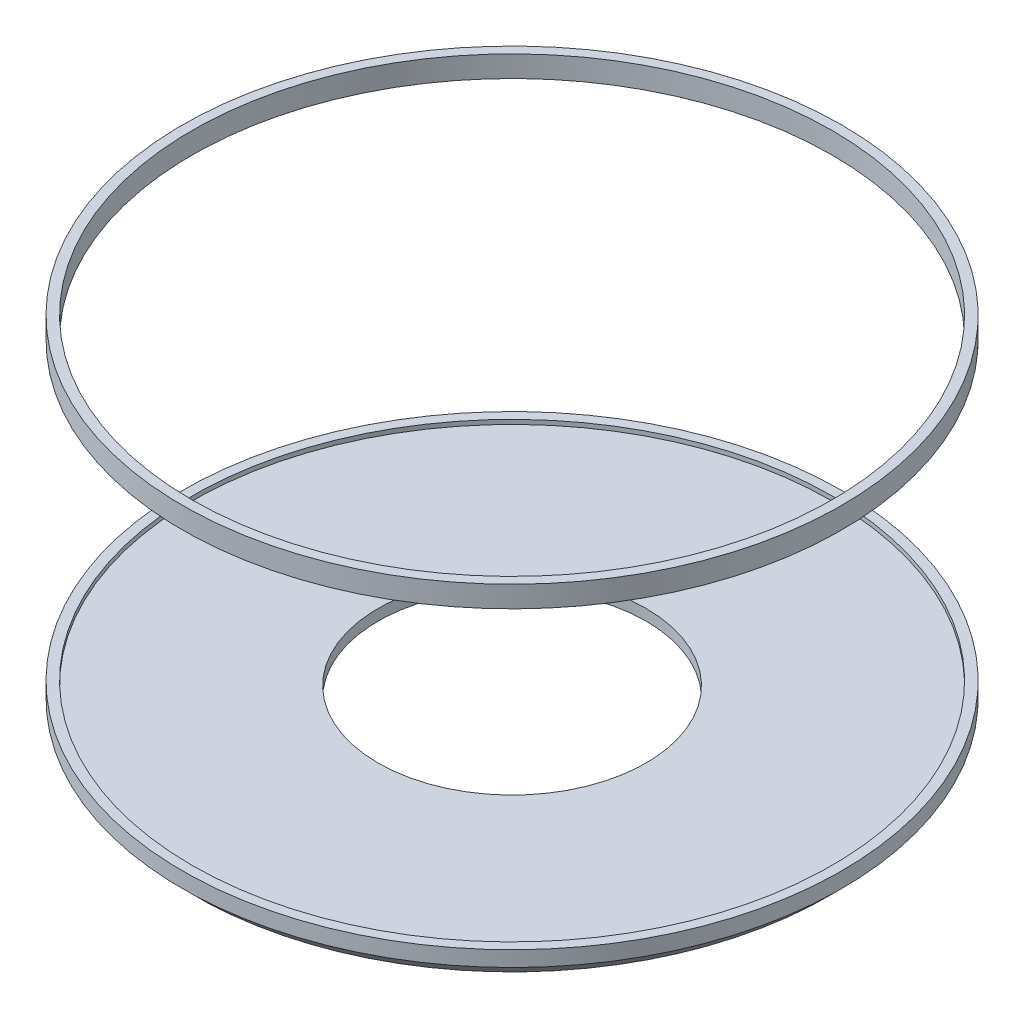
ISO-10303-21;
HEADER;
FILE_DESCRIPTION(('STEP AP214'),'2;1');
FILE_NAME('part.step','',(''),(''),'','','');
FILE_SCHEMA(('AUTOMOTIVE_DESIGN { 1 0 10303 214 1 1 1 1 }'));
ENDSEC;
DATA;
#1=APPLICATION_CONTEXT('core data for automotive mechanical design processes');
#2=APPLICATION_PROTOCOL_DEFINITION('international standard','automotive_design',2000,#1);
#3=PRODUCT_CONTEXT('',#1,'mechanical');
#4=PRODUCT('Part','Part','',(#3));
#5=PRODUCT_RELATED_PRODUCT_CATEGORY('part','',(#4));
#6=PRODUCT_DEFINITION_FORMATION('','',#4);
#7=PRODUCT_DEFINITION_CONTEXT('part definition',#1,'design');
#8=PRODUCT_DEFINITION('design','',#6,#7);
#9=PRODUCT_DEFINITION_SHAPE('','',#8);
#10=(LENGTH_UNIT() NAMED_UNIT(*) SI_UNIT(.MILLI.,.METRE.));
#11=(NAMED_UNIT(*) PLANE_ANGLE_UNIT() SI_UNIT($,.RADIAN.));
#12=(NAMED_UNIT(*) SI_UNIT($,.STERADIAN.) SOLID_ANGLE_UNIT());
#13=UNCERTAINTY_MEASURE_WITH_UNIT(LENGTH_MEASURE(1.E-05),#10,'distance_accuracy_value','');
#14=(GEOMETRIC_REPRESENTATION_CONTEXT(3) GLOBAL_UNCERTAINTY_ASSIGNED_CONTEXT((#13)) GLOBAL_UNIT_ASSIGNED_CONTEXT((#10,
#11,#12)) REPRESENTATION_CONTEXT('',''));
#15=CARTESIAN_POINT('',(0.,0.,0.));
#16=DIRECTION('',(0.,0.,1.));
#17=DIRECTION('',(1.,0.,0.));
#18=AXIS2_PLACEMENT_3D('',#15,#16,#17);
#19=CARTESIAN_POINT('',(0.,-66.5134428656852,0.));
#20=DIRECTION('',(0.,-1.,0.));
#21=DIRECTION('',(0.,0.,-1.));
#22=AXIS2_PLACEMENT_3D('',#19,#20,#21);
#23=CYLINDRICAL_SURFACE('',#22,54.2672855149634);
#24=CARTESIAN_POINT('',(0.,-66.5134428656852,0.));
#25=DIRECTION('',(0.,-1.,0.));
#26=DIRECTION('',(0.,0.,-1.));
#27=AXIS2_PLACEMENT_3D('',#24,#25,#26);
#28=CIRCLE('',#27,54.2672855149634);
#29=CARTESIAN_POINT('',(0.,-66.5134428656852,-54.2672855149634));
#30=VERTEX_POINT('',#29);
#31=EDGE_CURVE('E66',#30,#30,#28,.T.);
#32=ORIENTED_EDGE('',*,*,#31,.T.);
#33=EDGE_LOOP('',(#32));
#34=FACE_BOUND('',#33,.T.);
#35=CARTESIAN_POINT('',(0.,-62.0458327401122,0.));
#36=DIRECTION('',(0.,1.,0.));
#37=DIRECTION('',(0.,0.,1.));
#38=AXIS2_PLACEMENT_3D('',#35,#36,#37);
#39=CIRCLE('',#38,54.2672855149634);
#40=CARTESIAN_POINT('',(0.,-62.0458327401122,54.2672855149634));
#41=VERTEX_POINT('',#40);
#42=EDGE_CURVE('E57',#41,#41,#39,.T.);
#43=ORIENTED_EDGE('',*,*,#42,.T.);
#44=EDGE_LOOP('',(#43));
#45=FACE_BOUND('',#44,.T.);
#46=ADVANCED_FACE('F38',(#34,#45),#23,.F.);
#47=CARTESIAN_POINT('',(0.,-66.5134428656852,-54.2672855149634));
#48=DIRECTION('',(0.,-1.,0.));
#49=DIRECTION('',(0.,0.,-1.));
#50=AXIS2_PLACEMENT_3D('',#47,#48,#49);
#51=PLANE('',#50);
#52=CARTESIAN_POINT('',(0.,-66.5134428656852,0.));
#53=DIRECTION('',(0.,-1.,0.));
#54=DIRECTION('',(0.,0.,-1.));
#55=AXIS2_PLACEMENT_3D('',#52,#53,#54);
#56=CIRCLE('',#55,128.224471084029);
#57=CARTESIAN_POINT('',(0.,-66.5134428656852,-128.224471084029));
#58=VERTEX_POINT('',#57);
#59=EDGE_CURVE('E62',#58,#58,#56,.T.);
#60=ORIENTED_EDGE('',*,*,#59,.T.);
#61=EDGE_LOOP('',(#60));
#62=FACE_BOUND('',#61,.T.);
#63=ORIENTED_EDGE('',*,*,#31,.F.);
#64=EDGE_LOOP('',(#63));
#65=FACE_BOUND('',#64,.T.);
#66=ADVANCED_FACE('F84',(#62,#65),#51,.T.);
#67=CARTESIAN_POINT('',(0.,-66.5134428656852,0.));
#68=DIRECTION('',(0.,1.,0.));
#69=DIRECTION('',(0.,0.,1.));
#70=AXIS2_PLACEMENT_3D('',#67,#68,#69);
#71=CONICAL_SURFACE('',#70,133.507127196105,0.785398163397422);
#72=CARTESIAN_POINT('',(0.,-71.7960989777615,0.));
#73=DIRECTION('',(0.,-1.,0.));
#74=DIRECTION('',(0.,0.,-1.));
#75=AXIS2_PLACEMENT_3D('',#72,#73,#74);
#76=CIRCLE('',#75,128.224471084029);
#77=CARTESIAN_POINT('',(0.,-71.7960989777615,-128.224471084029));
#78=VERTEX_POINT('',#77);
#79=EDGE_CURVE('E54',#78,#78,#76,.T.);
#80=ORIENTED_EDGE('',*,*,#79,.F.);
#81=EDGE_LOOP('',(#80));
#82=FACE_BOUND('',#81,.T.);
#83=CARTESIAN_POINT('',(0.,-66.5134428656852,0.));
#84=DIRECTION('',(0.,-1.,0.));
#85=DIRECTION('',(0.,0.,-1.));
#86=AXIS2_PLACEMENT_3D('',#83,#84,#85);
#87=CIRCLE('',#86,133.507127196105);
#88=CARTESIAN_POINT('',(0.,-66.5134428656852,-133.507127196105));
#89=VERTEX_POINT('',#88);
#90=EDGE_CURVE('E59',#89,#89,#87,.T.);
#91=ORIENTED_EDGE('',*,*,#90,.T.);
#92=EDGE_LOOP('',(#91));
#93=FACE_BOUND('',#92,.T.);
#94=ADVANCED_FACE('F81',(#82,#93),#71,.T.);
#95=CARTESIAN_POINT('',(0.,-66.5134428656852,0.));
#96=DIRECTION('',(0.,-1.,0.));
#97=DIRECTION('',(0.,0.,-1.));
#98=AXIS2_PLACEMENT_3D('',#95,#96,#97);
#99=CYLINDRICAL_SURFACE('',#98,128.224471084029);
#100=ORIENTED_EDGE('',*,*,#59,.F.);
#101=EDGE_LOOP('',(#100));
#102=FACE_BOUND('',#101,.T.);
#103=ORIENTED_EDGE('',*,*,#79,.T.);
#104=EDGE_LOOP('',(#103));
#105=FACE_BOUND('',#104,.T.);
#106=ADVANCED_FACE('F90',(#102,#105),#99,.F.);
#107=CARTESIAN_POINT('',(0.,-66.5134428656852,0.));
#108=DIRECTION('',(0.,-1.,0.));
#109=DIRECTION('',(0.,0.,-1.));
#110=AXIS2_PLACEMENT_3D('',#107,#108,#109);
#111=CYLINDRICAL_SURFACE('',#110,133.507127196105);
#112=ORIENTED_EDGE('',*,*,#90,.F.);
#113=EDGE_LOOP('',(#112));
#114=FACE_BOUND('',#113,.T.);
#115=CARTESIAN_POINT('',(0.,-60.2703038241408,0.));
#116=DIRECTION('',(0.,-1.,0.));
#117=DIRECTION('',(0.,0.,-1.));
#118=AXIS2_PLACEMENT_3D('',#115,#116,#117);
#119=CIRCLE('',#118,133.507127196105);
#120=CARTESIAN_POINT('',(0.,-60.2703038241408,-133.507127196105));
#121=VERTEX_POINT('',#120);
#122=EDGE_CURVE('E49',#121,#121,#119,.T.);
#123=ORIENTED_EDGE('',*,*,#122,.T.);
#124=EDGE_LOOP('',(#123));
#125=FACE_BOUND('',#124,.T.);
#126=ADVANCED_FACE('F95',(#114,#125),#111,.T.);
#127=CARTESIAN_POINT('',(0.,-60.2703038241408,-128.224471084029));
#128=DIRECTION('',(0.,-1.,0.));
#129=DIRECTION('',(0.,0.,-1.));
#130=AXIS2_PLACEMENT_3D('',#127,#128,#129);
#131=PLANE('',#130);
#132=CARTESIAN_POINT('',(0.,-60.2703038241408,0.));
#133=DIRECTION('',(0.,-1.,0.));
#134=DIRECTION('',(0.,0.,-1.));
#135=AXIS2_PLACEMENT_3D('',#132,#133,#134);
#136=CIRCLE('',#135,129.627860529446);
#137=CARTESIAN_POINT('',(0.,-60.2703038241408,-129.627860529446));
#138=VERTEX_POINT('',#137);
#139=EDGE_CURVE('E45',#138,#138,#136,.T.);
#140=ORIENTED_EDGE('',*,*,#139,.T.);
#141=EDGE_LOOP('',(#140));
#142=FACE_BOUND('',#141,.T.);
#143=ORIENTED_EDGE('',*,*,#122,.F.);
#144=EDGE_LOOP('',(#143));
#145=FACE_BOUND('',#144,.T.);
#146=ADVANCED_FACE('F79',(#142,#145),#131,.F.);
#147=CARTESIAN_POINT('',(0.,-62.0458327401122,0.));
#148=DIRECTION('',(0.,1.,0.));
#149=DIRECTION('',(0.,0.,1.));
#150=AXIS2_PLACEMENT_3D('',#147,#148,#149);
#151=CYLINDRICAL_SURFACE('',#150,129.627860529446);
#152=CARTESIAN_POINT('',(0.,-62.0458327401122,0.));
#153=DIRECTION('',(0.,1.,0.));
#154=DIRECTION('',(0.,0.,1.));
#155=AXIS2_PLACEMENT_3D('',#152,#153,#154);
#156=CIRCLE('',#155,129.627860529446);
#157=CARTESIAN_POINT('',(0.,-62.0458327401122,129.627860529446));
#158=VERTEX_POINT('',#157);
#159=EDGE_CURVE('E11',#158,#158,#156,.T.);
#160=ORIENTED_EDGE('',*,*,#159,.F.);
#161=EDGE_LOOP('',(#160));
#162=FACE_BOUND('',#161,.T.);
#163=ORIENTED_EDGE('',*,*,#139,.F.);
#164=EDGE_LOOP('',(#163));
#165=FACE_BOUND('',#164,.T.);
#166=ADVANCED_FACE('F40',(#162,#165),#151,.F.);
#167=CARTESIAN_POINT('',(0.,-62.0458327401122,0.));
#168=DIRECTION('',(0.,1.,0.));
#169=DIRECTION('',(0.,0.,1.));
#170=AXIS2_PLACEMENT_3D('',#167,#168,#169);
#171=PLANE('',#170);
#172=ORIENTED_EDGE('',*,*,#42,.F.);
#173=EDGE_LOOP('',(#172));
#174=FACE_BOUND('',#173,.T.);
#175=ORIENTED_EDGE('',*,*,#159,.T.);
#176=EDGE_LOOP('',(#175));
#177=FACE_BOUND('',#176,.T.);
#178=ADVANCED_FACE('F74',(#174,#177),#171,.T.);
#179=CLOSED_SHELL('',(#46,#66,#94,#106,#126,#146,#166,#178));
#180=MANIFOLD_SOLID_BREP('B2',#179);
#181=CARTESIAN_POINT('',(0.,67.9541672598878,-133.507127196105));
#182=DIRECTION('',(0.,1.,0.));
#183=DIRECTION('',(0.,0.,1.));
#184=AXIS2_PLACEMENT_3D('',#181,#182,#183);
#185=PLANE('',#184);
#186=CARTESIAN_POINT('',(0.,67.9541672598878,0.));
#187=DIRECTION('',(0.,1.,0.));
#188=DIRECTION('',(0.,0.,1.));
#189=AXIS2_PLACEMENT_3D('',#186,#187,#188);
#190=CIRCLE('',#189,129.627860529446);
#191=CARTESIAN_POINT('',(0.,67.9541672598878,129.627860529446));
#192=VERTEX_POINT('',#191);
#193=EDGE_CURVE('E174',#192,#192,#190,.T.);
#194=ORIENTED_EDGE('',*,*,#193,.F.);
#195=EDGE_LOOP('',(#194));
#196=FACE_BOUND('',#195,.T.);
#197=CARTESIAN_POINT('',(0.,67.9541672598878,0.));
#198=DIRECTION('',(0.,-1.,0.));
#199=DIRECTION('',(0.,0.,-1.));
#200=AXIS2_PLACEMENT_3D('',#197,#198,#199);
#201=CIRCLE('',#200,133.507127196105);
#202=CARTESIAN_POINT('',(0.,67.9541672598878,-133.507127196105));
#203=VERTEX_POINT('',#202);
#204=EDGE_CURVE('E37',#203,#203,#201,.T.);
#205=ORIENTED_EDGE('',*,*,#204,.F.);
#206=EDGE_LOOP('',(#205));
#207=FACE_BOUND('',#206,.T.);
#208=ADVANCED_FACE('F160',(#196,#207),#185,.T.);
#209=CARTESIAN_POINT('',(0.,-66.5134428656852,0.));
#210=DIRECTION('',(0.,-1.,0.));
#211=DIRECTION('',(0.,0.,-1.));
#212=AXIS2_PLACEMENT_3D('',#209,#210,#211);
#213=CYLINDRICAL_SURFACE('',#212,133.507127196105);
#214=ORIENTED_EDGE('',*,*,#204,.T.);
#215=EDGE_LOOP('',(#214));
#216=FACE_BOUND('',#215,.T.);
#217=CARTESIAN_POINT('',(0.,59.3098208946724,0.));
#218=DIRECTION('',(0.,-1.,0.));
#219=DIRECTION('',(0.,0.,-1.));
#220=AXIS2_PLACEMENT_3D('',#217,#218,#219);
#221=CIRCLE('',#220,133.507127196105);
#222=CARTESIAN_POINT('',(0.,59.3098208946724,-133.507127196105));
#223=VERTEX_POINT('',#222);
#224=EDGE_CURVE('E166',#223,#223,#221,.T.);
#225=ORIENTED_EDGE('',*,*,#224,.F.);
#226=EDGE_LOOP('',(#225));
#227=FACE_BOUND('',#226,.T.);
#228=ADVANCED_FACE('F184',(#216,#227),#213,.T.);
#229=CARTESIAN_POINT('',(0.,59.3098208946724,-128.224471084029));
#230=DIRECTION('',(0.,-1.,0.));
#231=DIRECTION('',(0.,0.,-1.));
#232=AXIS2_PLACEMENT_3D('',#229,#230,#231);
#233=PLANE('',#232);
#234=CARTESIAN_POINT('',(0.,59.3098208946724,0.));
#235=DIRECTION('',(0.,-1.,0.));
#236=DIRECTION('',(0.,0.,-1.));
#237=AXIS2_PLACEMENT_3D('',#234,#235,#236);
#238=CIRCLE('',#237,129.627860529446);
#239=CARTESIAN_POINT('',(0.,59.3098208946724,-129.627860529446));
#240=VERTEX_POINT('',#239);
#241=EDGE_CURVE('E170',#240,#240,#238,.T.);
#242=ORIENTED_EDGE('',*,*,#241,.F.);
#243=EDGE_LOOP('',(#242));
#244=FACE_BOUND('',#243,.T.);
#245=ORIENTED_EDGE('',*,*,#224,.T.);
#246=EDGE_LOOP('',(#245));
#247=FACE_BOUND('',#246,.T.);
#248=ADVANCED_FACE('F190',(#244,#247),#233,.T.);
#249=CARTESIAN_POINT('',(0.,-62.0458327401122,0.));
#250=DIRECTION('',(0.,1.,0.));
#251=DIRECTION('',(0.,0.,1.));
#252=AXIS2_PLACEMENT_3D('',#249,#250,#251);
#253=CYLINDRICAL_SURFACE('',#252,129.627860529446);
#254=ORIENTED_EDGE('',*,*,#241,.T.);
#255=EDGE_LOOP('',(#254));
#256=FACE_BOUND('',#255,.T.);
#257=ORIENTED_EDGE('',*,*,#193,.T.);
#258=EDGE_LOOP('',(#257));
#259=FACE_BOUND('',#258,.T.);
#260=ADVANCED_FACE('F180',(#256,#259),#253,.F.);
#261=CLOSED_SHELL('',(#208,#228,#248,#260));
#262=MANIFOLD_SOLID_BREP('B6',#261);
#263=ADVANCED_BREP_SHAPE_REPRESENTATION('',(#18,#180,#262),#14);
#264=SHAPE_DEFINITION_REPRESENTATION(#9,#263);
ENDSEC;
END-ISO-10303-21;
